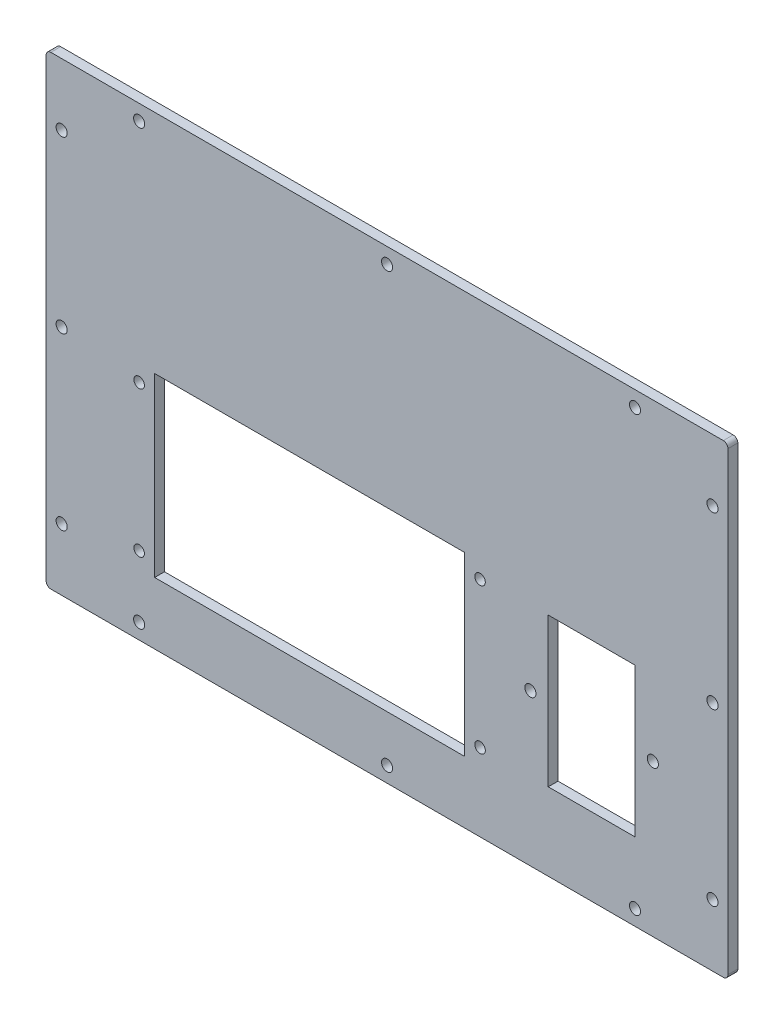
ISO-10303-21;
HEADER;
FILE_DESCRIPTION(('STEP AP214'),'2;1');
FILE_NAME('part.step','',(''),(''),'','','');
FILE_SCHEMA(('AUTOMOTIVE_DESIGN { 1 0 10303 214 1 1 1 1 }'));
ENDSEC;
DATA;
#1=APPLICATION_CONTEXT('core data for automotive mechanical design processes');
#2=APPLICATION_PROTOCOL_DEFINITION('international standard','automotive_design',2000,#1);
#3=PRODUCT_CONTEXT('',#1,'mechanical');
#4=PRODUCT('Part','Part','',(#3));
#5=PRODUCT_RELATED_PRODUCT_CATEGORY('part','',(#4));
#6=PRODUCT_DEFINITION_FORMATION('','',#4);
#7=PRODUCT_DEFINITION_CONTEXT('part definition',#1,'design');
#8=PRODUCT_DEFINITION('design','',#6,#7);
#9=PRODUCT_DEFINITION_SHAPE('','',#8);
#10=(LENGTH_UNIT() NAMED_UNIT(*) SI_UNIT(.MILLI.,.METRE.));
#11=(NAMED_UNIT(*) PLANE_ANGLE_UNIT() SI_UNIT($,.RADIAN.));
#12=(NAMED_UNIT(*) SI_UNIT($,.STERADIAN.) SOLID_ANGLE_UNIT());
#13=UNCERTAINTY_MEASURE_WITH_UNIT(LENGTH_MEASURE(1.E-05),#10,'distance_accuracy_value','');
#14=(GEOMETRIC_REPRESENTATION_CONTEXT(3) GLOBAL_UNCERTAINTY_ASSIGNED_CONTEXT((#13)) GLOBAL_UNIT_ASSIGNED_CONTEXT((#10,
#11,#12)) REPRESENTATION_CONTEXT('',''));
#15=CARTESIAN_POINT('',(0.,0.,0.));
#16=DIRECTION('',(0.,0.,1.));
#17=DIRECTION('',(1.,0.,0.));
#18=AXIS2_PLACEMENT_3D('',#15,#16,#17);
#19=CARTESIAN_POINT('',(0.,-75.,3.175));
#20=DIRECTION('',(0.,1.,0.));
#21=DIRECTION('',(0.,0.,1.));
#22=AXIS2_PLACEMENT_3D('',#19,#20,#21);
#23=PLANE('',#22);
#24=DIRECTION('',(1.,0.,0.));
#25=VECTOR('',#24,1.);
#26=CARTESIAN_POINT('',(0.,-75.,3.175));
#27=LINE('',#26,#25);
#28=CARTESIAN_POINT('',(-108.5,-75.,3.175));
#29=VERTEX_POINT('',#28);
#30=CARTESIAN_POINT('',(108.5,-75.,3.175));
#31=VERTEX_POINT('',#30);
#32=EDGE_CURVE('E311',#29,#31,#27,.T.);
#33=ORIENTED_EDGE('',*,*,#32,.F.);
#34=DIRECTION('',(0.,0.,-1.));
#35=VECTOR('',#34,1.);
#36=CARTESIAN_POINT('',(-108.5,-75.,0.));
#37=LINE('',#36,#35);
#38=CARTESIAN_POINT('',(-108.5,-75.,0.));
#39=VERTEX_POINT('',#38);
#40=EDGE_CURVE('E336',#29,#39,#37,.T.);
#41=ORIENTED_EDGE('',*,*,#40,.T.);
#42=DIRECTION('',(1.,0.,0.));
#43=VECTOR('',#42,1.);
#44=CARTESIAN_POINT('',(0.,-75.,0.));
#45=LINE('',#44,#43);
#46=CARTESIAN_POINT('',(108.5,-75.,0.));
#47=VERTEX_POINT('',#46);
#48=EDGE_CURVE('E310',#39,#47,#45,.T.);
#49=ORIENTED_EDGE('',*,*,#48,.T.);
#50=DIRECTION('',(0.,0.,-1.));
#51=VECTOR('',#50,1.);
#52=CARTESIAN_POINT('',(108.5,-75.,3.175));
#53=LINE('',#52,#51);
#54=EDGE_CURVE('E324',#47,#31,#53,.F.);
#55=ORIENTED_EDGE('',*,*,#54,.T.);
#56=EDGE_LOOP('',(#33,#41,#49,#55));
#57=FACE_BOUND('',#56,.T.);
#58=ADVANCED_FACE('F43',(#57),#23,.F.);
#59=CARTESIAN_POINT('',(110.,0.,3.175));
#60=DIRECTION('',(-1.,0.,0.));
#61=DIRECTION('',(0.,0.,1.));
#62=AXIS2_PLACEMENT_3D('',#59,#60,#61);
#63=PLANE('',#62);
#64=DIRECTION('',(0.,1.,0.));
#65=VECTOR('',#64,1.);
#66=CARTESIAN_POINT('',(110.,0.,3.175));
#67=LINE('',#66,#65);
#68=CARTESIAN_POINT('',(110.,-73.5,3.175));
#69=VERTEX_POINT('',#68);
#70=CARTESIAN_POINT('',(110.,73.5,3.175));
#71=VERTEX_POINT('',#70);
#72=EDGE_CURVE('E314',#69,#71,#67,.T.);
#73=ORIENTED_EDGE('',*,*,#72,.F.);
#74=DIRECTION('',(0.,0.,-1.));
#75=VECTOR('',#74,1.);
#76=CARTESIAN_POINT('',(110.,-73.5,3.175));
#77=LINE('',#76,#75);
#78=CARTESIAN_POINT('',(110.,-73.5,0.));
#79=VERTEX_POINT('',#78);
#80=EDGE_CURVE('E362',#69,#79,#77,.T.);
#81=ORIENTED_EDGE('',*,*,#80,.T.);
#82=DIRECTION('',(0.,1.,0.));
#83=VECTOR('',#82,1.);
#84=CARTESIAN_POINT('',(110.,0.,0.));
#85=LINE('',#84,#83);
#86=CARTESIAN_POINT('',(110.,73.5,0.));
#87=VERTEX_POINT('',#86);
#88=EDGE_CURVE('E327',#79,#87,#85,.T.);
#89=ORIENTED_EDGE('',*,*,#88,.T.);
#90=DIRECTION('',(0.,0.,-1.));
#91=VECTOR('',#90,1.);
#92=CARTESIAN_POINT('',(110.,73.5,3.175));
#93=LINE('',#92,#91);
#94=EDGE_CURVE('E360',#87,#71,#93,.F.);
#95=ORIENTED_EDGE('',*,*,#94,.T.);
#96=EDGE_LOOP('',(#73,#81,#89,#95));
#97=FACE_BOUND('',#96,.T.);
#98=ADVANCED_FACE('F397',(#97),#63,.F.);
#99=CARTESIAN_POINT('',(0.,75.,3.175));
#100=DIRECTION('',(0.,1.,0.));
#101=DIRECTION('',(0.,0.,1.));
#102=AXIS2_PLACEMENT_3D('',#99,#100,#101);
#103=PLANE('',#102);
#104=DIRECTION('',(1.,0.,0.));
#105=VECTOR('',#104,1.);
#106=CARTESIAN_POINT('',(0.,75.,3.175));
#107=LINE('',#106,#105);
#108=CARTESIAN_POINT('',(-108.5,75.,3.175));
#109=VERTEX_POINT('',#108);
#110=CARTESIAN_POINT('',(108.5,75.,3.175));
#111=VERTEX_POINT('',#110);
#112=EDGE_CURVE('E318',#109,#111,#107,.T.);
#113=ORIENTED_EDGE('',*,*,#112,.T.);
#114=DIRECTION('',(0.,0.,-1.));
#115=VECTOR('',#114,1.);
#116=CARTESIAN_POINT('',(108.5,75.,0.));
#117=LINE('',#116,#115);
#118=CARTESIAN_POINT('',(108.5,75.,0.));
#119=VERTEX_POINT('',#118);
#120=EDGE_CURVE('E11',#111,#119,#117,.T.);
#121=ORIENTED_EDGE('',*,*,#120,.T.);
#122=DIRECTION('',(1.,0.,0.));
#123=VECTOR('',#122,1.);
#124=CARTESIAN_POINT('',(0.,75.,0.));
#125=LINE('',#124,#123);
#126=CARTESIAN_POINT('',(-108.5,75.,0.));
#127=VERTEX_POINT('',#126);
#128=EDGE_CURVE('E330',#127,#119,#125,.T.);
#129=ORIENTED_EDGE('',*,*,#128,.F.);
#130=DIRECTION('',(0.,0.,-1.));
#131=VECTOR('',#130,1.);
#132=CARTESIAN_POINT('',(-108.5,75.,3.175));
#133=LINE('',#132,#131);
#134=EDGE_CURVE('E51',#127,#109,#133,.F.);
#135=ORIENTED_EDGE('',*,*,#134,.T.);
#136=EDGE_LOOP('',(#113,#121,#129,#135));
#137=FACE_BOUND('',#136,.T.);
#138=ADVANCED_FACE('F368',(#137),#103,.T.);
#139=CARTESIAN_POINT('',(-110.,0.,3.175));
#140=DIRECTION('',(-1.,0.,0.));
#141=DIRECTION('',(0.,0.,1.));
#142=AXIS2_PLACEMENT_3D('',#139,#140,#141);
#143=PLANE('',#142);
#144=DIRECTION('',(0.,1.,0.));
#145=VECTOR('',#144,1.);
#146=CARTESIAN_POINT('',(-110.,0.,0.));
#147=LINE('',#146,#145);
#148=CARTESIAN_POINT('',(-110.,-73.5,0.));
#149=VERTEX_POINT('',#148);
#150=CARTESIAN_POINT('',(-110.,73.5,0.));
#151=VERTEX_POINT('',#150);
#152=EDGE_CURVE('E315',#149,#151,#147,.T.);
#153=ORIENTED_EDGE('',*,*,#152,.F.);
#154=DIRECTION('',(0.,0.,-1.));
#155=VECTOR('',#154,1.);
#156=CARTESIAN_POINT('',(-110.,-73.5,3.175));
#157=LINE('',#156,#155);
#158=CARTESIAN_POINT('',(-110.,-73.5,3.175));
#159=VERTEX_POINT('',#158);
#160=EDGE_CURVE('E350',#149,#159,#157,.F.);
#161=ORIENTED_EDGE('',*,*,#160,.T.);
#162=DIRECTION('',(0.,1.,0.));
#163=VECTOR('',#162,1.);
#164=CARTESIAN_POINT('',(-110.,0.,3.175));
#165=LINE('',#164,#163);
#166=CARTESIAN_POINT('',(-110.,73.5,3.175));
#167=VERTEX_POINT('',#166);
#168=EDGE_CURVE('E321',#159,#167,#165,.T.);
#169=ORIENTED_EDGE('',*,*,#168,.T.);
#170=DIRECTION('',(0.,0.,-1.));
#171=VECTOR('',#170,1.);
#172=CARTESIAN_POINT('',(-110.,73.5,3.175));
#173=LINE('',#172,#171);
#174=EDGE_CURVE('E347',#167,#151,#173,.T.);
#175=ORIENTED_EDGE('',*,*,#174,.T.);
#176=EDGE_LOOP('',(#153,#161,#169,#175));
#177=FACE_BOUND('',#176,.T.);
#178=ADVANCED_FACE('F379',(#177),#143,.T.);
#179=CARTESIAN_POINT('',(0.,0.,3.175));
#180=DIRECTION('',(0.,0.,1.));
#181=DIRECTION('',(1.,0.,0.));
#182=AXIS2_PLACEMENT_3D('',#179,#180,#181);
#183=PLANE('',#182);
#184=CARTESIAN_POINT('',(-80.,-2.99999999999999,3.175));
#185=DIRECTION('',(0.,0.,1.));
#186=DIRECTION('',(1.,0.,0.));
#187=AXIS2_PLACEMENT_3D('',#184,#185,#186);
#188=CIRCLE('',#187,1.69999999999999);
#189=CARTESIAN_POINT('',(-78.3,-2.99999999999999,3.175));
#190=VERTEX_POINT('',#189);
#191=EDGE_CURVE('E831',#190,#190,#188,.T.);
#192=ORIENTED_EDGE('',*,*,#191,.F.);
#193=EDGE_LOOP('',(#192));
#194=FACE_BOUND('',#193,.T.);
#195=CARTESIAN_POINT('',(-80.,-50.,3.175));
#196=DIRECTION('',(0.,0.,1.));
#197=DIRECTION('',(1.,0.,0.));
#198=AXIS2_PLACEMENT_3D('',#195,#196,#197);
#199=CIRCLE('',#198,1.69999999999999);
#200=CARTESIAN_POINT('',(-78.3,-50.,3.175));
#201=VERTEX_POINT('',#200);
#202=EDGE_CURVE('E833',#201,#201,#199,.T.);
#203=ORIENTED_EDGE('',*,*,#202,.F.);
#204=EDGE_LOOP('',(#203));
#205=FACE_BOUND('',#204,.T.);
#206=CARTESIAN_POINT('',(30.,-50.,3.175));
#207=DIRECTION('',(0.,0.,1.));
#208=DIRECTION('',(1.,0.,0.));
#209=AXIS2_PLACEMENT_3D('',#206,#207,#208);
#210=CIRCLE('',#209,1.69999999999999);
#211=CARTESIAN_POINT('',(31.7,-50.,3.175));
#212=VERTEX_POINT('',#211);
#213=EDGE_CURVE('E841',#212,#212,#210,.T.);
#214=ORIENTED_EDGE('',*,*,#213,.F.);
#215=EDGE_LOOP('',(#214));
#216=FACE_BOUND('',#215,.T.);
#217=CARTESIAN_POINT('',(30.,-3.,3.175));
#218=DIRECTION('',(0.,0.,1.));
#219=DIRECTION('',(1.,0.,0.));
#220=AXIS2_PLACEMENT_3D('',#217,#218,#219);
#221=CIRCLE('',#220,1.69999999999999);
#222=CARTESIAN_POINT('',(31.7,-3.,3.175));
#223=VERTEX_POINT('',#222);
#224=EDGE_CURVE('E846',#223,#223,#221,.T.);
#225=ORIENTED_EDGE('',*,*,#224,.F.);
#226=EDGE_LOOP('',(#225));
#227=FACE_BOUND('',#226,.T.);
#228=DIRECTION('',(0.,-1.,0.));
#229=VECTOR('',#228,1.);
#230=CARTESIAN_POINT('',(-75.,2.00000000000001,3.175));
#231=LINE('',#230,#229);
#232=CARTESIAN_POINT('',(-75.,2.00000000000001,3.175));
#233=VERTEX_POINT('',#232);
#234=CARTESIAN_POINT('',(-75.,-55.,3.175));
#235=VERTEX_POINT('',#234);
#236=EDGE_CURVE('E58',#233,#235,#231,.T.);
#237=ORIENTED_EDGE('',*,*,#236,.F.);
#238=DIRECTION('',(-1.,0.,0.));
#239=VECTOR('',#238,1.);
#240=CARTESIAN_POINT('',(-75.,2.00000000000001,3.175));
#241=LINE('',#240,#239);
#242=CARTESIAN_POINT('',(25.,2.00000000000001,3.175));
#243=VERTEX_POINT('',#242);
#244=EDGE_CURVE('E174',#243,#233,#241,.T.);
#245=ORIENTED_EDGE('',*,*,#244,.F.);
#246=DIRECTION('',(0.,1.,0.));
#247=VECTOR('',#246,1.);
#248=CARTESIAN_POINT('',(25.,2.00000000000001,3.175));
#249=LINE('',#248,#247);
#250=CARTESIAN_POINT('',(25.,-55.,3.175));
#251=VERTEX_POINT('',#250);
#252=EDGE_CURVE('E177',#251,#243,#249,.T.);
#253=ORIENTED_EDGE('',*,*,#252,.F.);
#254=DIRECTION('',(1.,0.,0.));
#255=VECTOR('',#254,1.);
#256=CARTESIAN_POINT('',(-75.,-55.,3.175));
#257=LINE('',#256,#255);
#258=EDGE_CURVE('E186',#235,#251,#257,.T.);
#259=ORIENTED_EDGE('',*,*,#258,.F.);
#260=EDGE_LOOP('',(#237,#245,#253,#259));
#261=FACE_BOUND('',#260,.T.);
#262=CARTESIAN_POINT('',(46.25,-26.,3.175));
#263=DIRECTION('',(0.,0.,1.));
#264=DIRECTION('',(1.,0.,0.));
#265=AXIS2_PLACEMENT_3D('',#262,#263,#264);
#266=CIRCLE('',#265,1.8);
#267=CARTESIAN_POINT('',(48.05,-26.,3.175));
#268=VERTEX_POINT('',#267);
#269=EDGE_CURVE('E192',#268,#268,#266,.T.);
#270=ORIENTED_EDGE('',*,*,#269,.F.);
#271=EDGE_LOOP('',(#270));
#272=FACE_BOUND('',#271,.T.);
#273=CARTESIAN_POINT('',(85.75,-26.,3.175));
#274=DIRECTION('',(0.,0.,1.));
#275=DIRECTION('',(1.,0.,0.));
#276=AXIS2_PLACEMENT_3D('',#273,#274,#275);
#277=CIRCLE('',#276,1.8);
#278=CARTESIAN_POINT('',(87.55,-26.,3.175));
#279=VERTEX_POINT('',#278);
#280=EDGE_CURVE('E201',#279,#279,#277,.T.);
#281=ORIENTED_EDGE('',*,*,#280,.F.);
#282=EDGE_LOOP('',(#281));
#283=FACE_BOUND('',#282,.T.);
#284=DIRECTION('',(1.,0.,0.));
#285=VECTOR('',#284,1.);
#286=CARTESIAN_POINT('',(0.,-50.,3.175));
#287=LINE('',#286,#285);
#288=CARTESIAN_POINT('',(52.,-50.,3.175));
#289=VERTEX_POINT('',#288);
#290=CARTESIAN_POINT('',(80.,-50.,3.175));
#291=VERTEX_POINT('',#290);
#292=EDGE_CURVE('E207',#289,#291,#287,.T.);
#293=ORIENTED_EDGE('',*,*,#292,.F.);
#294=DIRECTION('',(0.,1.,0.));
#295=VECTOR('',#294,1.);
#296=CARTESIAN_POINT('',(52.,0.,3.175));
#297=LINE('',#296,#295);
#298=CARTESIAN_POINT('',(52.,-1.99999999999999,3.175));
#299=VERTEX_POINT('',#298);
#300=EDGE_CURVE('E212',#289,#299,#297,.T.);
#301=ORIENTED_EDGE('',*,*,#300,.T.);
#302=DIRECTION('',(1.,0.,0.));
#303=VECTOR('',#302,1.);
#304=CARTESIAN_POINT('',(0.,-1.99999999999999,3.175));
#305=LINE('',#304,#303);
#306=CARTESIAN_POINT('',(80.,-1.99999999999999,3.175));
#307=VERTEX_POINT('',#306);
#308=EDGE_CURVE('E225',#299,#307,#305,.T.);
#309=ORIENTED_EDGE('',*,*,#308,.T.);
#310=DIRECTION('',(0.,1.,0.));
#311=VECTOR('',#310,1.);
#312=CARTESIAN_POINT('',(80.,0.,3.175));
#313=LINE('',#312,#311);
#314=EDGE_CURVE('E222',#291,#307,#313,.T.);
#315=ORIENTED_EDGE('',*,*,#314,.F.);
#316=EDGE_LOOP('',(#293,#301,#309,#315));
#317=FACE_BOUND('',#316,.T.);
#318=CARTESIAN_POINT('',(-80.,70.,3.175));
#319=DIRECTION('',(0.,0.,1.));
#320=DIRECTION('',(1.,0.,0.));
#321=AXIS2_PLACEMENT_3D('',#318,#319,#320);
#322=CIRCLE('',#321,1.8);
#323=CARTESIAN_POINT('',(-78.2,70.,3.175));
#324=VERTEX_POINT('',#323);
#325=EDGE_CURVE('E232',#324,#324,#322,.T.);
#326=ORIENTED_EDGE('',*,*,#325,.F.);
#327=EDGE_LOOP('',(#326));
#328=FACE_BOUND('',#327,.T.);
#329=CARTESIAN_POINT('',(80.,70.,3.175));
#330=DIRECTION('',(0.,0.,1.));
#331=DIRECTION('',(1.,0.,0.));
#332=AXIS2_PLACEMENT_3D('',#329,#330,#331);
#333=CIRCLE('',#332,1.8);
#334=CARTESIAN_POINT('',(81.8,70.,3.175));
#335=VERTEX_POINT('',#334);
#336=EDGE_CURVE('E244',#335,#335,#333,.T.);
#337=ORIENTED_EDGE('',*,*,#336,.F.);
#338=EDGE_LOOP('',(#337));
#339=FACE_BOUND('',#338,.T.);
#340=CARTESIAN_POINT('',(0.,70.,3.175));
#341=DIRECTION('',(0.,0.,1.));
#342=DIRECTION('',(1.,0.,0.));
#343=AXIS2_PLACEMENT_3D('',#340,#341,#342);
#344=CIRCLE('',#343,1.8);
#345=CARTESIAN_POINT('',(1.8,70.,3.175));
#346=VERTEX_POINT('',#345);
#347=EDGE_CURVE('E250',#346,#346,#344,.T.);
#348=ORIENTED_EDGE('',*,*,#347,.F.);
#349=EDGE_LOOP('',(#348));
#350=FACE_BOUND('',#349,.T.);
#351=CARTESIAN_POINT('',(-105.,55.,3.175));
#352=DIRECTION('',(0.,0.,1.));
#353=DIRECTION('',(1.,0.,0.));
#354=AXIS2_PLACEMENT_3D('',#351,#352,#353);
#355=CIRCLE('',#354,1.8);
#356=CARTESIAN_POINT('',(-103.2,55.,3.175));
#357=VERTEX_POINT('',#356);
#358=EDGE_CURVE('E256',#357,#357,#355,.T.);
#359=ORIENTED_EDGE('',*,*,#358,.F.);
#360=EDGE_LOOP('',(#359));
#361=FACE_BOUND('',#360,.T.);
#362=CARTESIAN_POINT('',(-105.,0.,3.175));
#363=DIRECTION('',(0.,0.,1.));
#364=DIRECTION('',(1.,0.,0.));
#365=AXIS2_PLACEMENT_3D('',#362,#363,#364);
#366=CIRCLE('',#365,1.8);
#367=CARTESIAN_POINT('',(-103.2,0.,3.175));
#368=VERTEX_POINT('',#367);
#369=EDGE_CURVE('E262',#368,#368,#366,.T.);
#370=ORIENTED_EDGE('',*,*,#369,.F.);
#371=EDGE_LOOP('',(#370));
#372=FACE_BOUND('',#371,.T.);
#373=CARTESIAN_POINT('',(-105.,-55.,3.175));
#374=DIRECTION('',(0.,0.,1.));
#375=DIRECTION('',(1.,0.,0.));
#376=AXIS2_PLACEMENT_3D('',#373,#374,#375);
#377=CIRCLE('',#376,1.8);
#378=CARTESIAN_POINT('',(-103.2,-55.,3.175));
#379=VERTEX_POINT('',#378);
#380=EDGE_CURVE('E268',#379,#379,#377,.T.);
#381=ORIENTED_EDGE('',*,*,#380,.F.);
#382=EDGE_LOOP('',(#381));
#383=FACE_BOUND('',#382,.T.);
#384=CARTESIAN_POINT('',(-80.,-70.,3.175));
#385=DIRECTION('',(0.,0.,1.));
#386=DIRECTION('',(1.,0.,0.));
#387=AXIS2_PLACEMENT_3D('',#384,#385,#386);
#388=CIRCLE('',#387,1.8);
#389=CARTESIAN_POINT('',(-78.2,-70.,3.175));
#390=VERTEX_POINT('',#389);
#391=EDGE_CURVE('E274',#390,#390,#388,.T.);
#392=ORIENTED_EDGE('',*,*,#391,.F.);
#393=EDGE_LOOP('',(#392));
#394=FACE_BOUND('',#393,.T.);
#395=CARTESIAN_POINT('',(0.,-70.,3.175));
#396=DIRECTION('',(0.,0.,1.));
#397=DIRECTION('',(1.,0.,0.));
#398=AXIS2_PLACEMENT_3D('',#395,#396,#397);
#399=CIRCLE('',#398,1.8);
#400=CARTESIAN_POINT('',(1.80000000000003,-70.,3.175));
#401=VERTEX_POINT('',#400);
#402=EDGE_CURVE('E280',#401,#401,#399,.T.);
#403=ORIENTED_EDGE('',*,*,#402,.F.);
#404=EDGE_LOOP('',(#403));
#405=FACE_BOUND('',#404,.T.);
#406=CARTESIAN_POINT('',(80.,-69.9999999999999,3.175));
#407=DIRECTION('',(0.,0.,1.));
#408=DIRECTION('',(1.,0.,0.));
#409=AXIS2_PLACEMENT_3D('',#406,#407,#408);
#410=CIRCLE('',#409,1.8);
#411=CARTESIAN_POINT('',(81.8,-69.9999999999999,3.175));
#412=VERTEX_POINT('',#411);
#413=EDGE_CURVE('E286',#412,#412,#410,.T.);
#414=ORIENTED_EDGE('',*,*,#413,.F.);
#415=EDGE_LOOP('',(#414));
#416=FACE_BOUND('',#415,.T.);
#417=CARTESIAN_POINT('',(105.,-55.,3.175));
#418=DIRECTION('',(0.,0.,1.));
#419=DIRECTION('',(1.,0.,0.));
#420=AXIS2_PLACEMENT_3D('',#417,#418,#419);
#421=CIRCLE('',#420,1.8);
#422=CARTESIAN_POINT('',(106.8,-55.,3.175));
#423=VERTEX_POINT('',#422);
#424=EDGE_CURVE('E292',#423,#423,#421,.T.);
#425=ORIENTED_EDGE('',*,*,#424,.F.);
#426=EDGE_LOOP('',(#425));
#427=FACE_BOUND('',#426,.T.);
#428=CARTESIAN_POINT('',(105.,0.,3.175));
#429=DIRECTION('',(0.,0.,1.));
#430=DIRECTION('',(1.,0.,0.));
#431=AXIS2_PLACEMENT_3D('',#428,#429,#430);
#432=CIRCLE('',#431,1.8);
#433=CARTESIAN_POINT('',(106.8,0.,3.175));
#434=VERTEX_POINT('',#433);
#435=EDGE_CURVE('E298',#434,#434,#432,.T.);
#436=ORIENTED_EDGE('',*,*,#435,.F.);
#437=EDGE_LOOP('',(#436));
#438=FACE_BOUND('',#437,.T.);
#439=CARTESIAN_POINT('',(105.,55.,3.175));
#440=DIRECTION('',(0.,0.,1.));
#441=DIRECTION('',(1.,0.,0.));
#442=AXIS2_PLACEMENT_3D('',#439,#440,#441);
#443=CIRCLE('',#442,1.8);
#444=CARTESIAN_POINT('',(106.8,55.,3.175));
#445=VERTEX_POINT('',#444);
#446=EDGE_CURVE('E304',#445,#445,#443,.T.);
#447=ORIENTED_EDGE('',*,*,#446,.F.);
#448=EDGE_LOOP('',(#447));
#449=FACE_BOUND('',#448,.T.);
#450=ORIENTED_EDGE('',*,*,#168,.F.);
#451=CARTESIAN_POINT('',(-108.5,-73.5,3.175));
#452=DIRECTION('',(0.,0.,1.));
#453=DIRECTION('',(1.,0.,0.));
#454=AXIS2_PLACEMENT_3D('',#451,#452,#453);
#455=CIRCLE('',#454,1.5);
#456=EDGE_CURVE('E358',#159,#29,#455,.T.);
#457=ORIENTED_EDGE('',*,*,#456,.T.);
#458=ORIENTED_EDGE('',*,*,#32,.T.);
#459=CARTESIAN_POINT('',(108.5,-73.5,3.175));
#460=DIRECTION('',(0.,0.,1.));
#461=DIRECTION('',(1.,0.,0.));
#462=AXIS2_PLACEMENT_3D('',#459,#460,#461);
#463=CIRCLE('',#462,1.5);
#464=EDGE_CURVE('E356',#31,#69,#463,.T.);
#465=ORIENTED_EDGE('',*,*,#464,.T.);
#466=ORIENTED_EDGE('',*,*,#72,.T.);
#467=CARTESIAN_POINT('',(108.5,73.5,3.175));
#468=DIRECTION('',(0.,0.,1.));
#469=DIRECTION('',(1.,0.,0.));
#470=AXIS2_PLACEMENT_3D('',#467,#468,#469);
#471=CIRCLE('',#470,1.5);
#472=EDGE_CURVE('E354',#71,#111,#471,.T.);
#473=ORIENTED_EDGE('',*,*,#472,.T.);
#474=ORIENTED_EDGE('',*,*,#112,.F.);
#475=CARTESIAN_POINT('',(-108.5,73.5,3.175));
#476=DIRECTION('',(0.,0.,1.));
#477=DIRECTION('',(1.,0.,0.));
#478=AXIS2_PLACEMENT_3D('',#475,#476,#477);
#479=CIRCLE('',#478,1.5);
#480=EDGE_CURVE('E352',#109,#167,#479,.T.);
#481=ORIENTED_EDGE('',*,*,#480,.T.);
#482=EDGE_LOOP('',(#450,#457,#458,#465,#466,#473,#474,#481));
#483=FACE_BOUND('',#482,.T.);
#484=ADVANCED_FACE('F374',(#194,#205,#216,#227,#261,#272,#283,#317,#328,#339,#350,#361,#372,
#383,#394,#405,#416,#427,#438,#449,#483),#183,.T.);
#485=CARTESIAN_POINT('',(0.,0.,0.));
#486=DIRECTION('',(0.,0.,1.));
#487=DIRECTION('',(1.,0.,0.));
#488=AXIS2_PLACEMENT_3D('',#485,#486,#487);
#489=PLANE('',#488);
#490=CARTESIAN_POINT('',(-80.,-2.99999999999999,0.));
#491=DIRECTION('',(0.,0.,1.));
#492=DIRECTION('',(1.,0.,0.));
#493=AXIS2_PLACEMENT_3D('',#490,#491,#492);
#494=CIRCLE('',#493,1.69999999999999);
#495=CARTESIAN_POINT('',(-78.3,-2.99999999999999,0.));
#496=VERTEX_POINT('',#495);
#497=EDGE_CURVE('E828',#496,#496,#494,.T.);
#498=ORIENTED_EDGE('',*,*,#497,.T.);
#499=EDGE_LOOP('',(#498));
#500=FACE_BOUND('',#499,.T.);
#501=CARTESIAN_POINT('',(-80.,-50.,0.));
#502=DIRECTION('',(0.,0.,1.));
#503=DIRECTION('',(1.,0.,0.));
#504=AXIS2_PLACEMENT_3D('',#501,#502,#503);
#505=CIRCLE('',#504,1.69999999999999);
#506=CARTESIAN_POINT('',(-78.3,-50.,0.));
#507=VERTEX_POINT('',#506);
#508=EDGE_CURVE('E838',#507,#507,#505,.T.);
#509=ORIENTED_EDGE('',*,*,#508,.T.);
#510=EDGE_LOOP('',(#509));
#511=FACE_BOUND('',#510,.T.);
#512=CARTESIAN_POINT('',(30.,-50.,0.));
#513=DIRECTION('',(0.,0.,1.));
#514=DIRECTION('',(1.,0.,0.));
#515=AXIS2_PLACEMENT_3D('',#512,#513,#514);
#516=CIRCLE('',#515,1.7);
#517=CARTESIAN_POINT('',(31.7,-50.,0.));
#518=VERTEX_POINT('',#517);
#519=EDGE_CURVE('E844',#518,#518,#516,.T.);
#520=ORIENTED_EDGE('',*,*,#519,.T.);
#521=EDGE_LOOP('',(#520));
#522=FACE_BOUND('',#521,.T.);
#523=CARTESIAN_POINT('',(30.,-3.,0.));
#524=DIRECTION('',(0.,0.,1.));
#525=DIRECTION('',(1.,0.,0.));
#526=AXIS2_PLACEMENT_3D('',#523,#524,#525);
#527=CIRCLE('',#526,1.7);
#528=CARTESIAN_POINT('',(31.7,-3.,0.));
#529=VERTEX_POINT('',#528);
#530=EDGE_CURVE('E180',#529,#529,#527,.T.);
#531=ORIENTED_EDGE('',*,*,#530,.T.);
#532=EDGE_LOOP('',(#531));
#533=FACE_BOUND('',#532,.T.);
#534=DIRECTION('',(-1.,0.,0.));
#535=VECTOR('',#534,1.);
#536=CARTESIAN_POINT('',(-75.,2.00000000000001,0.));
#537=LINE('',#536,#535);
#538=CARTESIAN_POINT('',(25.,2.00000000000001,0.));
#539=VERTEX_POINT('',#538);
#540=CARTESIAN_POINT('',(-75.,2.00000000000001,0.));
#541=VERTEX_POINT('',#540);
#542=EDGE_CURVE('E164',#539,#541,#537,.T.);
#543=ORIENTED_EDGE('',*,*,#542,.T.);
#544=DIRECTION('',(0.,-1.,0.));
#545=VECTOR('',#544,1.);
#546=CARTESIAN_POINT('',(-75.,2.00000000000001,0.));
#547=LINE('',#546,#545);
#548=CARTESIAN_POINT('',(-75.,-55.,0.));
#549=VERTEX_POINT('',#548);
#550=EDGE_CURVE('E158',#541,#549,#547,.T.);
#551=ORIENTED_EDGE('',*,*,#550,.T.);
#552=DIRECTION('',(1.,0.,0.));
#553=VECTOR('',#552,1.);
#554=CARTESIAN_POINT('',(-75.,-55.,0.));
#555=LINE('',#554,#553);
#556=CARTESIAN_POINT('',(25.,-55.,0.));
#557=VERTEX_POINT('',#556);
#558=EDGE_CURVE('E167',#549,#557,#555,.T.);
#559=ORIENTED_EDGE('',*,*,#558,.T.);
#560=DIRECTION('',(0.,1.,0.));
#561=VECTOR('',#560,1.);
#562=CARTESIAN_POINT('',(25.,2.00000000000001,0.));
#563=LINE('',#562,#561);
#564=EDGE_CURVE('E66',#557,#539,#563,.T.);
#565=ORIENTED_EDGE('',*,*,#564,.T.);
#566=EDGE_LOOP('',(#543,#551,#559,#565));
#567=FACE_BOUND('',#566,.T.);
#568=CARTESIAN_POINT('',(46.25,-26.,0.));
#569=DIRECTION('',(0.,0.,1.));
#570=DIRECTION('',(1.,0.,0.));
#571=AXIS2_PLACEMENT_3D('',#568,#569,#570);
#572=CIRCLE('',#571,1.8);
#573=CARTESIAN_POINT('',(48.05,-26.,0.));
#574=VERTEX_POINT('',#573);
#575=EDGE_CURVE('E198',#574,#574,#572,.T.);
#576=ORIENTED_EDGE('',*,*,#575,.T.);
#577=EDGE_LOOP('',(#576));
#578=FACE_BOUND('',#577,.T.);
#579=CARTESIAN_POINT('',(85.75,-26.,0.));
#580=DIRECTION('',(0.,0.,1.));
#581=DIRECTION('',(1.,0.,0.));
#582=AXIS2_PLACEMENT_3D('',#579,#580,#581);
#583=CIRCLE('',#582,1.8);
#584=CARTESIAN_POINT('',(87.55,-26.,0.));
#585=VERTEX_POINT('',#584);
#586=EDGE_CURVE('E204',#585,#585,#583,.T.);
#587=ORIENTED_EDGE('',*,*,#586,.T.);
#588=EDGE_LOOP('',(#587));
#589=FACE_BOUND('',#588,.T.);
#590=DIRECTION('',(0.,1.,0.));
#591=VECTOR('',#590,1.);
#592=CARTESIAN_POINT('',(52.,0.,0.));
#593=LINE('',#592,#591);
#594=CARTESIAN_POINT('',(52.,-50.,0.));
#595=VERTEX_POINT('',#594);
#596=CARTESIAN_POINT('',(52.,-1.99999999999999,0.));
#597=VERTEX_POINT('',#596);
#598=EDGE_CURVE('E218',#595,#597,#593,.T.);
#599=ORIENTED_EDGE('',*,*,#598,.F.);
#600=DIRECTION('',(1.,0.,0.));
#601=VECTOR('',#600,1.);
#602=CARTESIAN_POINT('',(0.,-50.,0.));
#603=LINE('',#602,#601);
#604=CARTESIAN_POINT('',(80.,-50.,0.));
#605=VERTEX_POINT('',#604);
#606=EDGE_CURVE('E208',#595,#605,#603,.T.);
#607=ORIENTED_EDGE('',*,*,#606,.T.);
#608=DIRECTION('',(0.,1.,0.));
#609=VECTOR('',#608,1.);
#610=CARTESIAN_POINT('',(80.,0.,0.));
#611=LINE('',#610,#609);
#612=CARTESIAN_POINT('',(80.,-1.99999999999999,0.));
#613=VERTEX_POINT('',#612);
#614=EDGE_CURVE('E211',#605,#613,#611,.T.);
#615=ORIENTED_EDGE('',*,*,#614,.T.);
#616=DIRECTION('',(1.,0.,0.));
#617=VECTOR('',#616,1.);
#618=CARTESIAN_POINT('',(0.,-1.99999999999999,0.));
#619=LINE('',#618,#617);
#620=EDGE_CURVE('E215',#597,#613,#619,.T.);
#621=ORIENTED_EDGE('',*,*,#620,.F.);
#622=EDGE_LOOP('',(#599,#607,#615,#621));
#623=FACE_BOUND('',#622,.T.);
#624=CARTESIAN_POINT('',(-80.,70.,0.));
#625=DIRECTION('',(0.,0.,1.));
#626=DIRECTION('',(1.,0.,0.));
#627=AXIS2_PLACEMENT_3D('',#624,#625,#626);
#628=CIRCLE('',#627,1.8);
#629=CARTESIAN_POINT('',(-78.2,70.,0.));
#630=VERTEX_POINT('',#629);
#631=EDGE_CURVE('E241',#630,#630,#628,.T.);
#632=ORIENTED_EDGE('',*,*,#631,.T.);
#633=EDGE_LOOP('',(#632));
#634=FACE_BOUND('',#633,.T.);
#635=CARTESIAN_POINT('',(80.,70.,0.));
#636=DIRECTION('',(0.,0.,1.));
#637=DIRECTION('',(1.,0.,0.));
#638=AXIS2_PLACEMENT_3D('',#635,#636,#637);
#639=CIRCLE('',#638,1.8);
#640=CARTESIAN_POINT('',(81.8,70.,0.));
#641=VERTEX_POINT('',#640);
#642=EDGE_CURVE('E247',#641,#641,#639,.T.);
#643=ORIENTED_EDGE('',*,*,#642,.T.);
#644=EDGE_LOOP('',(#643));
#645=FACE_BOUND('',#644,.T.);
#646=CARTESIAN_POINT('',(0.,70.,0.));
#647=DIRECTION('',(0.,0.,1.));
#648=DIRECTION('',(1.,0.,0.));
#649=AXIS2_PLACEMENT_3D('',#646,#647,#648);
#650=CIRCLE('',#649,1.8);
#651=CARTESIAN_POINT('',(1.8,70.,0.));
#652=VERTEX_POINT('',#651);
#653=EDGE_CURVE('E253',#652,#652,#650,.T.);
#654=ORIENTED_EDGE('',*,*,#653,.T.);
#655=EDGE_LOOP('',(#654));
#656=FACE_BOUND('',#655,.T.);
#657=CARTESIAN_POINT('',(-105.,55.,0.));
#658=DIRECTION('',(0.,0.,1.));
#659=DIRECTION('',(1.,0.,0.));
#660=AXIS2_PLACEMENT_3D('',#657,#658,#659);
#661=CIRCLE('',#660,1.8);
#662=CARTESIAN_POINT('',(-103.2,55.,0.));
#663=VERTEX_POINT('',#662);
#664=EDGE_CURVE('E259',#663,#663,#661,.T.);
#665=ORIENTED_EDGE('',*,*,#664,.T.);
#666=EDGE_LOOP('',(#665));
#667=FACE_BOUND('',#666,.T.);
#668=CARTESIAN_POINT('',(-105.,0.,0.));
#669=DIRECTION('',(0.,0.,1.));
#670=DIRECTION('',(1.,0.,0.));
#671=AXIS2_PLACEMENT_3D('',#668,#669,#670);
#672=CIRCLE('',#671,1.8);
#673=CARTESIAN_POINT('',(-103.2,0.,0.));
#674=VERTEX_POINT('',#673);
#675=EDGE_CURVE('E265',#674,#674,#672,.T.);
#676=ORIENTED_EDGE('',*,*,#675,.T.);
#677=EDGE_LOOP('',(#676));
#678=FACE_BOUND('',#677,.T.);
#679=CARTESIAN_POINT('',(-105.,-55.,0.));
#680=DIRECTION('',(0.,0.,1.));
#681=DIRECTION('',(1.,0.,0.));
#682=AXIS2_PLACEMENT_3D('',#679,#680,#681);
#683=CIRCLE('',#682,1.8);
#684=CARTESIAN_POINT('',(-103.2,-55.,0.));
#685=VERTEX_POINT('',#684);
#686=EDGE_CURVE('E271',#685,#685,#683,.T.);
#687=ORIENTED_EDGE('',*,*,#686,.T.);
#688=EDGE_LOOP('',(#687));
#689=FACE_BOUND('',#688,.T.);
#690=CARTESIAN_POINT('',(-80.,-70.,0.));
#691=DIRECTION('',(0.,0.,1.));
#692=DIRECTION('',(1.,0.,0.));
#693=AXIS2_PLACEMENT_3D('',#690,#691,#692);
#694=CIRCLE('',#693,1.8);
#695=CARTESIAN_POINT('',(-78.2,-70.,0.));
#696=VERTEX_POINT('',#695);
#697=EDGE_CURVE('E277',#696,#696,#694,.T.);
#698=ORIENTED_EDGE('',*,*,#697,.T.);
#699=EDGE_LOOP('',(#698));
#700=FACE_BOUND('',#699,.T.);
#701=CARTESIAN_POINT('',(0.,-70.,0.));
#702=DIRECTION('',(0.,0.,1.));
#703=DIRECTION('',(1.,0.,0.));
#704=AXIS2_PLACEMENT_3D('',#701,#702,#703);
#705=CIRCLE('',#704,1.8);
#706=CARTESIAN_POINT('',(1.80000000000003,-70.,0.));
#707=VERTEX_POINT('',#706);
#708=EDGE_CURVE('E283',#707,#707,#705,.T.);
#709=ORIENTED_EDGE('',*,*,#708,.T.);
#710=EDGE_LOOP('',(#709));
#711=FACE_BOUND('',#710,.T.);
#712=CARTESIAN_POINT('',(80.,-69.9999999999999,0.));
#713=DIRECTION('',(0.,0.,1.));
#714=DIRECTION('',(1.,0.,0.));
#715=AXIS2_PLACEMENT_3D('',#712,#713,#714);
#716=CIRCLE('',#715,1.8);
#717=CARTESIAN_POINT('',(81.8,-69.9999999999999,0.));
#718=VERTEX_POINT('',#717);
#719=EDGE_CURVE('E289',#718,#718,#716,.T.);
#720=ORIENTED_EDGE('',*,*,#719,.T.);
#721=EDGE_LOOP('',(#720));
#722=FACE_BOUND('',#721,.T.);
#723=CARTESIAN_POINT('',(105.,-55.,0.));
#724=DIRECTION('',(0.,0.,1.));
#725=DIRECTION('',(1.,0.,0.));
#726=AXIS2_PLACEMENT_3D('',#723,#724,#725);
#727=CIRCLE('',#726,1.8);
#728=CARTESIAN_POINT('',(106.8,-55.,0.));
#729=VERTEX_POINT('',#728);
#730=EDGE_CURVE('E295',#729,#729,#727,.T.);
#731=ORIENTED_EDGE('',*,*,#730,.T.);
#732=EDGE_LOOP('',(#731));
#733=FACE_BOUND('',#732,.T.);
#734=CARTESIAN_POINT('',(105.,0.,0.));
#735=DIRECTION('',(0.,0.,1.));
#736=DIRECTION('',(1.,0.,0.));
#737=AXIS2_PLACEMENT_3D('',#734,#735,#736);
#738=CIRCLE('',#737,1.8);
#739=CARTESIAN_POINT('',(106.8,0.,0.));
#740=VERTEX_POINT('',#739);
#741=EDGE_CURVE('E301',#740,#740,#738,.T.);
#742=ORIENTED_EDGE('',*,*,#741,.T.);
#743=EDGE_LOOP('',(#742));
#744=FACE_BOUND('',#743,.T.);
#745=CARTESIAN_POINT('',(105.,55.,0.));
#746=DIRECTION('',(0.,0.,1.));
#747=DIRECTION('',(1.,0.,0.));
#748=AXIS2_PLACEMENT_3D('',#745,#746,#747);
#749=CIRCLE('',#748,1.8);
#750=CARTESIAN_POINT('',(106.8,55.,0.));
#751=VERTEX_POINT('',#750);
#752=EDGE_CURVE('E307',#751,#751,#749,.T.);
#753=ORIENTED_EDGE('',*,*,#752,.T.);
#754=EDGE_LOOP('',(#753));
#755=FACE_BOUND('',#754,.T.);
#756=ORIENTED_EDGE('',*,*,#48,.F.);
#757=CARTESIAN_POINT('',(-108.5,-73.5,0.));
#758=DIRECTION('',(0.,0.,1.));
#759=DIRECTION('',(1.,0.,0.));
#760=AXIS2_PLACEMENT_3D('',#757,#758,#759);
#761=CIRCLE('',#760,1.5);
#762=EDGE_CURVE('E345',#39,#149,#761,.F.);
#763=ORIENTED_EDGE('',*,*,#762,.T.);
#764=ORIENTED_EDGE('',*,*,#152,.T.);
#765=CARTESIAN_POINT('',(-108.5,73.5,0.));
#766=DIRECTION('',(0.,0.,1.));
#767=DIRECTION('',(1.,0.,0.));
#768=AXIS2_PLACEMENT_3D('',#765,#766,#767);
#769=CIRCLE('',#768,1.5);
#770=EDGE_CURVE('E339',#151,#127,#769,.F.);
#771=ORIENTED_EDGE('',*,*,#770,.T.);
#772=ORIENTED_EDGE('',*,*,#128,.T.);
#773=CARTESIAN_POINT('',(108.5,73.5,0.));
#774=DIRECTION('',(0.,0.,1.));
#775=DIRECTION('',(1.,0.,0.));
#776=AXIS2_PLACEMENT_3D('',#773,#774,#775);
#777=CIRCLE('',#776,1.5);
#778=EDGE_CURVE('E341',#119,#87,#777,.F.);
#779=ORIENTED_EDGE('',*,*,#778,.T.);
#780=ORIENTED_EDGE('',*,*,#88,.F.);
#781=CARTESIAN_POINT('',(108.5,-73.5,0.));
#782=DIRECTION('',(0.,0.,1.));
#783=DIRECTION('',(1.,0.,0.));
#784=AXIS2_PLACEMENT_3D('',#781,#782,#783);
#785=CIRCLE('',#784,1.5);
#786=EDGE_CURVE('E343',#79,#47,#785,.F.);
#787=ORIENTED_EDGE('',*,*,#786,.T.);
#788=EDGE_LOOP('',(#756,#763,#764,#771,#772,#779,#780,#787));
#789=FACE_BOUND('',#788,.T.);
#790=ADVANCED_FACE('F171',(#500,#511,#522,#533,#567,#578,#589,#623,#634,#645,#656,#667,#678,
#689,#700,#711,#722,#733,#744,#755,#789),#489,.F.);
#791=CARTESIAN_POINT('',(105.,55.,3.175));
#792=DIRECTION('',(0.,0.,1.));
#793=DIRECTION('',(1.,0.,0.));
#794=AXIS2_PLACEMENT_3D('',#791,#792,#793);
#795=CYLINDRICAL_SURFACE('',#794,1.8);
#796=ORIENTED_EDGE('',*,*,#752,.F.);
#797=EDGE_LOOP('',(#796));
#798=FACE_BOUND('',#797,.T.);
#799=ORIENTED_EDGE('',*,*,#446,.T.);
#800=EDGE_LOOP('',(#799));
#801=FACE_BOUND('',#800,.T.);
#802=ADVANCED_FACE('F469',(#798,#801),#795,.F.);
#803=CARTESIAN_POINT('',(105.,0.,3.175));
#804=DIRECTION('',(0.,0.,1.));
#805=DIRECTION('',(1.,0.,0.));
#806=AXIS2_PLACEMENT_3D('',#803,#804,#805);
#807=CYLINDRICAL_SURFACE('',#806,1.8);
#808=ORIENTED_EDGE('',*,*,#741,.F.);
#809=EDGE_LOOP('',(#808));
#810=FACE_BOUND('',#809,.T.);
#811=ORIENTED_EDGE('',*,*,#435,.T.);
#812=EDGE_LOOP('',(#811));
#813=FACE_BOUND('',#812,.T.);
#814=ADVANCED_FACE('F465',(#810,#813),#807,.F.);
#815=CARTESIAN_POINT('',(105.,-55.,3.175));
#816=DIRECTION('',(0.,0.,1.));
#817=DIRECTION('',(1.,0.,0.));
#818=AXIS2_PLACEMENT_3D('',#815,#816,#817);
#819=CYLINDRICAL_SURFACE('',#818,1.8);
#820=ORIENTED_EDGE('',*,*,#730,.F.);
#821=EDGE_LOOP('',(#820));
#822=FACE_BOUND('',#821,.T.);
#823=ORIENTED_EDGE('',*,*,#424,.T.);
#824=EDGE_LOOP('',(#823));
#825=FACE_BOUND('',#824,.T.);
#826=ADVANCED_FACE('F461',(#822,#825),#819,.F.);
#827=CARTESIAN_POINT('',(80.,-69.9999999999999,3.175));
#828=DIRECTION('',(0.,0.,1.));
#829=DIRECTION('',(1.,0.,0.));
#830=AXIS2_PLACEMENT_3D('',#827,#828,#829);
#831=CYLINDRICAL_SURFACE('',#830,1.8);
#832=ORIENTED_EDGE('',*,*,#719,.F.);
#833=EDGE_LOOP('',(#832));
#834=FACE_BOUND('',#833,.T.);
#835=ORIENTED_EDGE('',*,*,#413,.T.);
#836=EDGE_LOOP('',(#835));
#837=FACE_BOUND('',#836,.T.);
#838=ADVANCED_FACE('F457',(#834,#837),#831,.F.);
#839=CARTESIAN_POINT('',(0.,-70.,3.175));
#840=DIRECTION('',(0.,0.,1.));
#841=DIRECTION('',(1.,0.,0.));
#842=AXIS2_PLACEMENT_3D('',#839,#840,#841);
#843=CYLINDRICAL_SURFACE('',#842,1.8);
#844=ORIENTED_EDGE('',*,*,#708,.F.);
#845=EDGE_LOOP('',(#844));
#846=FACE_BOUND('',#845,.T.);
#847=ORIENTED_EDGE('',*,*,#402,.T.);
#848=EDGE_LOOP('',(#847));
#849=FACE_BOUND('',#848,.T.);
#850=ADVANCED_FACE('F453',(#846,#849),#843,.F.);
#851=CARTESIAN_POINT('',(-80.,-70.,3.175));
#852=DIRECTION('',(0.,0.,1.));
#853=DIRECTION('',(1.,0.,0.));
#854=AXIS2_PLACEMENT_3D('',#851,#852,#853);
#855=CYLINDRICAL_SURFACE('',#854,1.8);
#856=ORIENTED_EDGE('',*,*,#697,.F.);
#857=EDGE_LOOP('',(#856));
#858=FACE_BOUND('',#857,.T.);
#859=ORIENTED_EDGE('',*,*,#391,.T.);
#860=EDGE_LOOP('',(#859));
#861=FACE_BOUND('',#860,.T.);
#862=ADVANCED_FACE('F449',(#858,#861),#855,.F.);
#863=CARTESIAN_POINT('',(-105.,-55.,3.175));
#864=DIRECTION('',(0.,0.,1.));
#865=DIRECTION('',(1.,0.,0.));
#866=AXIS2_PLACEMENT_3D('',#863,#864,#865);
#867=CYLINDRICAL_SURFACE('',#866,1.8);
#868=ORIENTED_EDGE('',*,*,#686,.F.);
#869=EDGE_LOOP('',(#868));
#870=FACE_BOUND('',#869,.T.);
#871=ORIENTED_EDGE('',*,*,#380,.T.);
#872=EDGE_LOOP('',(#871));
#873=FACE_BOUND('',#872,.T.);
#874=ADVANCED_FACE('F445',(#870,#873),#867,.F.);
#875=CARTESIAN_POINT('',(-105.,0.,3.175));
#876=DIRECTION('',(0.,0.,1.));
#877=DIRECTION('',(1.,0.,0.));
#878=AXIS2_PLACEMENT_3D('',#875,#876,#877);
#879=CYLINDRICAL_SURFACE('',#878,1.8);
#880=ORIENTED_EDGE('',*,*,#675,.F.);
#881=EDGE_LOOP('',(#880));
#882=FACE_BOUND('',#881,.T.);
#883=ORIENTED_EDGE('',*,*,#369,.T.);
#884=EDGE_LOOP('',(#883));
#885=FACE_BOUND('',#884,.T.);
#886=ADVANCED_FACE('F441',(#882,#885),#879,.F.);
#887=CARTESIAN_POINT('',(-105.,55.,3.175));
#888=DIRECTION('',(0.,0.,1.));
#889=DIRECTION('',(1.,0.,0.));
#890=AXIS2_PLACEMENT_3D('',#887,#888,#889);
#891=CYLINDRICAL_SURFACE('',#890,1.8);
#892=ORIENTED_EDGE('',*,*,#664,.F.);
#893=EDGE_LOOP('',(#892));
#894=FACE_BOUND('',#893,.T.);
#895=ORIENTED_EDGE('',*,*,#358,.T.);
#896=EDGE_LOOP('',(#895));
#897=FACE_BOUND('',#896,.T.);
#898=ADVANCED_FACE('F437',(#894,#897),#891,.F.);
#899=CARTESIAN_POINT('',(0.,70.,3.175));
#900=DIRECTION('',(0.,0.,1.));
#901=DIRECTION('',(1.,0.,0.));
#902=AXIS2_PLACEMENT_3D('',#899,#900,#901);
#903=CYLINDRICAL_SURFACE('',#902,1.8);
#904=ORIENTED_EDGE('',*,*,#653,.F.);
#905=EDGE_LOOP('',(#904));
#906=FACE_BOUND('',#905,.T.);
#907=ORIENTED_EDGE('',*,*,#347,.T.);
#908=EDGE_LOOP('',(#907));
#909=FACE_BOUND('',#908,.T.);
#910=ADVANCED_FACE('F427',(#906,#909),#903,.F.);
#911=CARTESIAN_POINT('',(80.,70.,3.175));
#912=DIRECTION('',(0.,0.,1.));
#913=DIRECTION('',(1.,0.,0.));
#914=AXIS2_PLACEMENT_3D('',#911,#912,#913);
#915=CYLINDRICAL_SURFACE('',#914,1.8);
#916=ORIENTED_EDGE('',*,*,#642,.F.);
#917=EDGE_LOOP('',(#916));
#918=FACE_BOUND('',#917,.T.);
#919=ORIENTED_EDGE('',*,*,#336,.T.);
#920=EDGE_LOOP('',(#919));
#921=FACE_BOUND('',#920,.T.);
#922=ADVANCED_FACE('F421',(#918,#921),#915,.F.);
#923=CARTESIAN_POINT('',(-80.,70.,3.175));
#924=DIRECTION('',(0.,0.,1.));
#925=DIRECTION('',(1.,0.,0.));
#926=AXIS2_PLACEMENT_3D('',#923,#924,#925);
#927=CYLINDRICAL_SURFACE('',#926,1.8);
#928=ORIENTED_EDGE('',*,*,#631,.F.);
#929=EDGE_LOOP('',(#928));
#930=FACE_BOUND('',#929,.T.);
#931=ORIENTED_EDGE('',*,*,#325,.T.);
#932=EDGE_LOOP('',(#931));
#933=FACE_BOUND('',#932,.T.);
#934=ADVANCED_FACE('F417',(#930,#933),#927,.F.);
#935=CARTESIAN_POINT('',(-108.5,-73.5,3.175));
#936=DIRECTION('',(0.,0.,1.));
#937=DIRECTION('',(1.,0.,0.));
#938=AXIS2_PLACEMENT_3D('',#935,#936,#937);
#939=CYLINDRICAL_SURFACE('',#938,1.5);
#940=ORIENTED_EDGE('',*,*,#456,.F.);
#941=ORIENTED_EDGE('',*,*,#160,.F.);
#942=ORIENTED_EDGE('',*,*,#762,.F.);
#943=ORIENTED_EDGE('',*,*,#40,.F.);
#944=EDGE_LOOP('',(#940,#941,#942,#943));
#945=FACE_BOUND('',#944,.T.);
#946=ADVANCED_FACE('F386',(#945),#939,.T.);
#947=CARTESIAN_POINT('',(108.5,-73.5,3.175));
#948=DIRECTION('',(0.,0.,-1.));
#949=DIRECTION('',(-1.,0.,0.));
#950=AXIS2_PLACEMENT_3D('',#947,#948,#949);
#951=CYLINDRICAL_SURFACE('',#950,1.5);
#952=ORIENTED_EDGE('',*,*,#464,.F.);
#953=ORIENTED_EDGE('',*,*,#54,.F.);
#954=ORIENTED_EDGE('',*,*,#786,.F.);
#955=ORIENTED_EDGE('',*,*,#80,.F.);
#956=EDGE_LOOP('',(#952,#953,#954,#955));
#957=FACE_BOUND('',#956,.T.);
#958=ADVANCED_FACE('F394',(#957),#951,.T.);
#959=CARTESIAN_POINT('',(108.5,73.5,3.175));
#960=DIRECTION('',(0.,0.,1.));
#961=DIRECTION('',(1.,0.,0.));
#962=AXIS2_PLACEMENT_3D('',#959,#960,#961);
#963=CYLINDRICAL_SURFACE('',#962,1.5);
#964=ORIENTED_EDGE('',*,*,#472,.F.);
#965=ORIENTED_EDGE('',*,*,#94,.F.);
#966=ORIENTED_EDGE('',*,*,#778,.F.);
#967=ORIENTED_EDGE('',*,*,#120,.F.);
#968=EDGE_LOOP('',(#964,#965,#966,#967));
#969=FACE_BOUND('',#968,.T.);
#970=ADVANCED_FACE('F400',(#969),#963,.T.);
#971=CARTESIAN_POINT('',(-108.5,73.5,3.175));
#972=DIRECTION('',(0.,0.,-1.));
#973=DIRECTION('',(-1.,0.,0.));
#974=AXIS2_PLACEMENT_3D('',#971,#972,#973);
#975=CYLINDRICAL_SURFACE('',#974,1.5);
#976=ORIENTED_EDGE('',*,*,#480,.F.);
#977=ORIENTED_EDGE('',*,*,#134,.F.);
#978=ORIENTED_EDGE('',*,*,#770,.F.);
#979=ORIENTED_EDGE('',*,*,#174,.F.);
#980=EDGE_LOOP('',(#976,#977,#978,#979));
#981=FACE_BOUND('',#980,.T.);
#982=ADVANCED_FACE('F45',(#981),#975,.T.);
#983=CARTESIAN_POINT('',(0.,-50.,0.));
#984=DIRECTION('',(0.,-1.,0.));
#985=DIRECTION('',(0.,0.,-1.));
#986=AXIS2_PLACEMENT_3D('',#983,#984,#985);
#987=PLANE('',#986);
#988=ORIENTED_EDGE('',*,*,#292,.T.);
#989=DIRECTION('',(0.,0.,1.));
#990=VECTOR('',#989,1.);
#991=CARTESIAN_POINT('',(80.,-50.,0.));
#992=LINE('',#991,#990);
#993=EDGE_CURVE('E220',#605,#291,#992,.T.);
#994=ORIENTED_EDGE('',*,*,#993,.F.);
#995=ORIENTED_EDGE('',*,*,#606,.F.);
#996=DIRECTION('',(0.,0.,1.));
#997=VECTOR('',#996,1.);
#998=CARTESIAN_POINT('',(52.,-50.,0.));
#999=LINE('',#998,#997);
#1000=EDGE_CURVE('E230',#595,#289,#999,.T.);
#1001=ORIENTED_EDGE('',*,*,#1000,.T.);
#1002=EDGE_LOOP('',(#988,#994,#995,#1001));
#1003=FACE_BOUND('',#1002,.T.);
#1004=ADVANCED_FACE('F406',(#1003),#987,.F.);
#1005=CARTESIAN_POINT('',(52.,0.,0.));
#1006=DIRECTION('',(1.,0.,0.));
#1007=DIRECTION('',(0.,0.,-1.));
#1008=AXIS2_PLACEMENT_3D('',#1005,#1006,#1007);
#1009=PLANE('',#1008);
#1010=ORIENTED_EDGE('',*,*,#300,.F.);
#1011=ORIENTED_EDGE('',*,*,#1000,.F.);
#1012=ORIENTED_EDGE('',*,*,#598,.T.);
#1013=DIRECTION('',(0.,0.,1.));
#1014=VECTOR('',#1013,1.);
#1015=CARTESIAN_POINT('',(52.,-1.99999999999999,0.));
#1016=LINE('',#1015,#1014);
#1017=EDGE_CURVE('E233',#597,#299,#1016,.T.);
#1018=ORIENTED_EDGE('',*,*,#1017,.T.);
#1019=EDGE_LOOP('',(#1010,#1011,#1012,#1018));
#1020=FACE_BOUND('',#1019,.T.);
#1021=ADVANCED_FACE('F658',(#1020),#1009,.T.);
#1022=CARTESIAN_POINT('',(0.,-1.99999999999999,0.));
#1023=DIRECTION('',(0.,-1.,0.));
#1024=DIRECTION('',(0.,0.,-1.));
#1025=AXIS2_PLACEMENT_3D('',#1022,#1023,#1024);
#1026=PLANE('',#1025);
#1027=ORIENTED_EDGE('',*,*,#308,.F.);
#1028=ORIENTED_EDGE('',*,*,#1017,.F.);
#1029=ORIENTED_EDGE('',*,*,#620,.T.);
#1030=DIRECTION('',(0.,0.,1.));
#1031=VECTOR('',#1030,1.);
#1032=CARTESIAN_POINT('',(80.,-1.99999999999999,0.));
#1033=LINE('',#1032,#1031);
#1034=EDGE_CURVE('E235',#613,#307,#1033,.T.);
#1035=ORIENTED_EDGE('',*,*,#1034,.T.);
#1036=EDGE_LOOP('',(#1027,#1028,#1029,#1035));
#1037=FACE_BOUND('',#1036,.T.);
#1038=ADVANCED_FACE('F661',(#1037),#1026,.T.);
#1039=CARTESIAN_POINT('',(80.,0.,0.));
#1040=DIRECTION('',(1.,0.,0.));
#1041=DIRECTION('',(0.,0.,-1.));
#1042=AXIS2_PLACEMENT_3D('',#1039,#1040,#1041);
#1043=PLANE('',#1042);
#1044=ORIENTED_EDGE('',*,*,#314,.T.);
#1045=ORIENTED_EDGE('',*,*,#1034,.F.);
#1046=ORIENTED_EDGE('',*,*,#614,.F.);
#1047=ORIENTED_EDGE('',*,*,#993,.T.);
#1048=EDGE_LOOP('',(#1044,#1045,#1046,#1047));
#1049=FACE_BOUND('',#1048,.T.);
#1050=ADVANCED_FACE('F656',(#1049),#1043,.F.);
#1051=CARTESIAN_POINT('',(85.75,-26.,3.175));
#1052=DIRECTION('',(0.,0.,1.));
#1053=DIRECTION('',(1.,0.,0.));
#1054=AXIS2_PLACEMENT_3D('',#1051,#1052,#1053);
#1055=CYLINDRICAL_SURFACE('',#1054,1.8);
#1056=ORIENTED_EDGE('',*,*,#586,.F.);
#1057=EDGE_LOOP('',(#1056));
#1058=FACE_BOUND('',#1057,.T.);
#1059=ORIENTED_EDGE('',*,*,#280,.T.);
#1060=EDGE_LOOP('',(#1059));
#1061=FACE_BOUND('',#1060,.T.);
#1062=ADVANCED_FACE('F652',(#1058,#1061),#1055,.F.);
#1063=CARTESIAN_POINT('',(46.25,-26.,3.175));
#1064=DIRECTION('',(0.,0.,1.));
#1065=DIRECTION('',(1.,0.,0.));
#1066=AXIS2_PLACEMENT_3D('',#1063,#1064,#1065);
#1067=CYLINDRICAL_SURFACE('',#1066,1.8);
#1068=ORIENTED_EDGE('',*,*,#575,.F.);
#1069=EDGE_LOOP('',(#1068));
#1070=FACE_BOUND('',#1069,.T.);
#1071=ORIENTED_EDGE('',*,*,#269,.T.);
#1072=EDGE_LOOP('',(#1071));
#1073=FACE_BOUND('',#1072,.T.);
#1074=ADVANCED_FACE('F649',(#1070,#1073),#1067,.F.);
#1075=CARTESIAN_POINT('',(-75.,2.00000000000001,0.));
#1076=DIRECTION('',(-1.,0.,0.));
#1077=DIRECTION('',(0.,-1.,0.));
#1078=AXIS2_PLACEMENT_3D('',#1075,#1076,#1077);
#1079=PLANE('',#1078);
#1080=ORIENTED_EDGE('',*,*,#236,.T.);
#1081=DIRECTION('',(0.,0.,1.));
#1082=VECTOR('',#1081,1.);
#1083=CARTESIAN_POINT('',(-75.,-55.,0.));
#1084=LINE('',#1083,#1082);
#1085=EDGE_CURVE('E154',#549,#235,#1084,.T.);
#1086=ORIENTED_EDGE('',*,*,#1085,.F.);
#1087=ORIENTED_EDGE('',*,*,#550,.F.);
#1088=DIRECTION('',(0.,0.,1.));
#1089=VECTOR('',#1088,1.);
#1090=CARTESIAN_POINT('',(-75.,2.00000000000001,0.));
#1091=LINE('',#1090,#1089);
#1092=EDGE_CURVE('E190',#541,#233,#1091,.T.);
#1093=ORIENTED_EDGE('',*,*,#1092,.T.);
#1094=EDGE_LOOP('',(#1080,#1086,#1087,#1093));
#1095=FACE_BOUND('',#1094,.T.);
#1096=ADVANCED_FACE('F156',(#1095),#1079,.F.);
#1097=CARTESIAN_POINT('',(-75.,2.00000000000001,0.));
#1098=DIRECTION('',(0.,1.,0.));
#1099=DIRECTION('',(0.,0.,1.));
#1100=AXIS2_PLACEMENT_3D('',#1097,#1098,#1099);
#1101=PLANE('',#1100);
#1102=ORIENTED_EDGE('',*,*,#244,.T.);
#1103=ORIENTED_EDGE('',*,*,#1092,.F.);
#1104=ORIENTED_EDGE('',*,*,#542,.F.);
#1105=DIRECTION('',(0.,0.,1.));
#1106=VECTOR('',#1105,1.);
#1107=CARTESIAN_POINT('',(25.,2.00000000000001,0.));
#1108=LINE('',#1107,#1106);
#1109=EDGE_CURVE('E193',#539,#243,#1108,.T.);
#1110=ORIENTED_EDGE('',*,*,#1109,.T.);
#1111=EDGE_LOOP('',(#1102,#1103,#1104,#1110));
#1112=FACE_BOUND('',#1111,.T.);
#1113=ADVANCED_FACE('F639',(#1112),#1101,.F.);
#1114=CARTESIAN_POINT('',(25.,2.00000000000001,0.));
#1115=DIRECTION('',(1.,0.,0.));
#1116=DIRECTION('',(0.,1.,0.));
#1117=AXIS2_PLACEMENT_3D('',#1114,#1115,#1116);
#1118=PLANE('',#1117);
#1119=ORIENTED_EDGE('',*,*,#252,.T.);
#1120=ORIENTED_EDGE('',*,*,#1109,.F.);
#1121=ORIENTED_EDGE('',*,*,#564,.F.);
#1122=DIRECTION('',(0.,0.,1.));
#1123=VECTOR('',#1122,1.);
#1124=CARTESIAN_POINT('',(25.,-55.,0.));
#1125=LINE('',#1124,#1123);
#1126=EDGE_CURVE('E163',#557,#251,#1125,.T.);
#1127=ORIENTED_EDGE('',*,*,#1126,.T.);
#1128=EDGE_LOOP('',(#1119,#1120,#1121,#1127));
#1129=FACE_BOUND('',#1128,.T.);
#1130=ADVANCED_FACE('F642',(#1129),#1118,.F.);
#1131=CARTESIAN_POINT('',(-75.,-55.,0.));
#1132=DIRECTION('',(0.,-1.,0.));
#1133=DIRECTION('',(0.,0.,-1.));
#1134=AXIS2_PLACEMENT_3D('',#1131,#1132,#1133);
#1135=PLANE('',#1134);
#1136=ORIENTED_EDGE('',*,*,#258,.T.);
#1137=ORIENTED_EDGE('',*,*,#1126,.F.);
#1138=ORIENTED_EDGE('',*,*,#558,.F.);
#1139=ORIENTED_EDGE('',*,*,#1085,.T.);
#1140=EDGE_LOOP('',(#1136,#1137,#1138,#1139));
#1141=FACE_BOUND('',#1140,.T.);
#1142=ADVANCED_FACE('F168',(#1141),#1135,.F.);
#1143=CARTESIAN_POINT('',(30.,-3.,3.175));
#1144=DIRECTION('',(0.,0.,1.));
#1145=DIRECTION('',(1.,0.,0.));
#1146=AXIS2_PLACEMENT_3D('',#1143,#1144,#1145);
#1147=CYLINDRICAL_SURFACE('',#1146,1.69999999999999);
#1148=ORIENTED_EDGE('',*,*,#530,.F.);
#1149=EDGE_LOOP('',(#1148));
#1150=FACE_BOUND('',#1149,.T.);
#1151=ORIENTED_EDGE('',*,*,#224,.T.);
#1152=EDGE_LOOP('',(#1151));
#1153=FACE_BOUND('',#1152,.T.);
#1154=ADVANCED_FACE('F595',(#1150,#1153),#1147,.F.);
#1155=CARTESIAN_POINT('',(30.,-50.,3.175));
#1156=DIRECTION('',(0.,0.,1.));
#1157=DIRECTION('',(1.,0.,0.));
#1158=AXIS2_PLACEMENT_3D('',#1155,#1156,#1157);
#1159=CYLINDRICAL_SURFACE('',#1158,1.69999999999999);
#1160=ORIENTED_EDGE('',*,*,#519,.F.);
#1161=EDGE_LOOP('',(#1160));
#1162=FACE_BOUND('',#1161,.T.);
#1163=ORIENTED_EDGE('',*,*,#213,.T.);
#1164=EDGE_LOOP('',(#1163));
#1165=FACE_BOUND('',#1164,.T.);
#1166=ADVANCED_FACE('F600',(#1162,#1165),#1159,.F.);
#1167=CARTESIAN_POINT('',(-80.,-50.,3.175));
#1168=DIRECTION('',(0.,0.,1.));
#1169=DIRECTION('',(1.,0.,0.));
#1170=AXIS2_PLACEMENT_3D('',#1167,#1168,#1169);
#1171=CYLINDRICAL_SURFACE('',#1170,1.69999999999999);
#1172=ORIENTED_EDGE('',*,*,#508,.F.);
#1173=EDGE_LOOP('',(#1172));
#1174=FACE_BOUND('',#1173,.T.);
#1175=ORIENTED_EDGE('',*,*,#202,.T.);
#1176=EDGE_LOOP('',(#1175));
#1177=FACE_BOUND('',#1176,.T.);
#1178=ADVANCED_FACE('F612',(#1174,#1177),#1171,.F.);
#1179=CARTESIAN_POINT('',(-80.,-2.99999999999999,3.175));
#1180=DIRECTION('',(0.,0.,1.));
#1181=DIRECTION('',(1.,0.,0.));
#1182=AXIS2_PLACEMENT_3D('',#1179,#1180,#1181);
#1183=CYLINDRICAL_SURFACE('',#1182,1.69999999999999);
#1184=ORIENTED_EDGE('',*,*,#497,.F.);
#1185=EDGE_LOOP('',(#1184));
#1186=FACE_BOUND('',#1185,.T.);
#1187=ORIENTED_EDGE('',*,*,#191,.T.);
#1188=EDGE_LOOP('',(#1187));
#1189=FACE_BOUND('',#1188,.T.);
#1190=ADVANCED_FACE('F622',(#1186,#1189),#1183,.F.);
#1191=CLOSED_SHELL('',(#58,#98,#138,#178,#484,#790,#802,#814,#826,#838,#850,#862,#874,#886,#898,
#910,#922,#934,#946,#958,#970,#982,#1004,#1021,#1038,#1050,#1062,#1074,#1096,#1113,#1130,#1142,
#1154,#1166,#1178,#1190));
#1192=MANIFOLD_SOLID_BREP('B2',#1191);
#1193=ADVANCED_BREP_SHAPE_REPRESENTATION('',(#18,#1192),#14);
#1194=SHAPE_DEFINITION_REPRESENTATION(#9,#1193);
ENDSEC;
END-ISO-10303-21;
